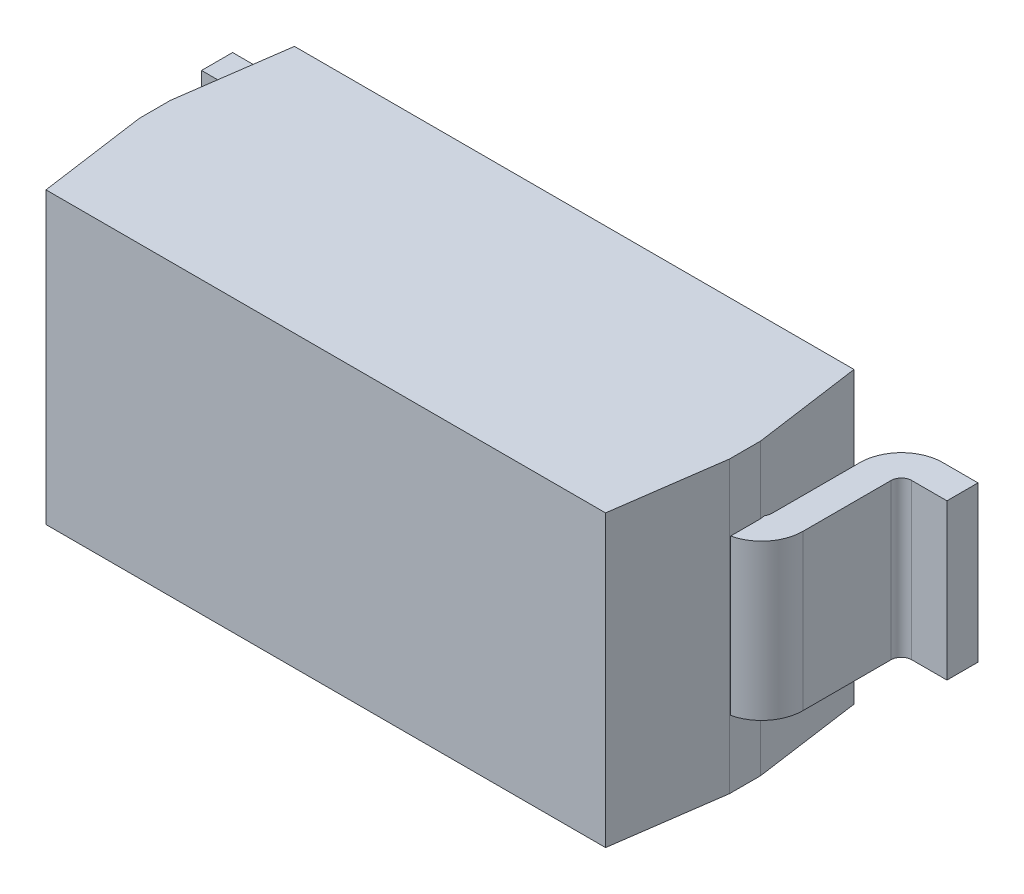
ISO-10303-21;
HEADER;
FILE_DESCRIPTION(('STEP AP214'),'2;1');
FILE_NAME('part.step','',(''),(''),'','','');
FILE_SCHEMA(('AUTOMOTIVE_DESIGN { 1 0 10303 214 1 1 1 1 }'));
ENDSEC;
DATA;
#1=APPLICATION_CONTEXT('core data for automotive mechanical design processes');
#2=APPLICATION_PROTOCOL_DEFINITION('international standard','automotive_design',2000,#1);
#3=PRODUCT_CONTEXT('',#1,'mechanical');
#4=PRODUCT('Part','Part','',(#3));
#5=PRODUCT_RELATED_PRODUCT_CATEGORY('part','',(#4));
#6=PRODUCT_DEFINITION_FORMATION('','',#4);
#7=PRODUCT_DEFINITION_CONTEXT('part definition',#1,'design');
#8=PRODUCT_DEFINITION('design','',#6,#7);
#9=PRODUCT_DEFINITION_SHAPE('','',#8);
#10=(LENGTH_UNIT() NAMED_UNIT(*) SI_UNIT(.MILLI.,.METRE.));
#11=(NAMED_UNIT(*) PLANE_ANGLE_UNIT() SI_UNIT($,.RADIAN.));
#12=(NAMED_UNIT(*) SI_UNIT($,.STERADIAN.) SOLID_ANGLE_UNIT());
#13=UNCERTAINTY_MEASURE_WITH_UNIT(LENGTH_MEASURE(1.E-05),#10,'distance_accuracy_value','');
#14=(GEOMETRIC_REPRESENTATION_CONTEXT(3) GLOBAL_UNCERTAINTY_ASSIGNED_CONTEXT((#13)) GLOBAL_UNIT_ASSIGNED_CONTEXT((#10,
#11,#12)) REPRESENTATION_CONTEXT('',''));
#15=CARTESIAN_POINT('',(0.,0.,0.));
#16=DIRECTION('',(0.,0.,1.));
#17=DIRECTION('',(1.,0.,0.));
#18=AXIS2_PLACEMENT_3D('',#15,#16,#17);
#19=CARTESIAN_POINT('',(1.425,0.,0.75));
#20=DIRECTION('',(-1.,0.,0.));
#21=DIRECTION('',(0.,0.,1.));
#22=AXIS2_PLACEMENT_3D('',#19,#20,#21);
#23=PLANE('',#22);
#24=DIRECTION('',(0.,0.,1.));
#25=VECTOR('',#24,1.);
#26=CARTESIAN_POINT('',(1.425,-0.7,0.75));
#27=LINE('',#26,#25);
#28=CARTESIAN_POINT('',(1.425,-0.7,0.675));
#29=VERTEX_POINT('',#28);
#30=CARTESIAN_POINT('',(1.425,-0.7,0.825));
#31=VERTEX_POINT('',#30);
#32=EDGE_CURVE('E367',#29,#31,#27,.T.);
#33=ORIENTED_EDGE('',*,*,#32,.F.);
#34=DIRECTION('',(0.,1.,0.));
#35=VECTOR('',#34,1.);
#36=CARTESIAN_POINT('',(1.425,0.,0.675));
#37=LINE('',#36,#35);
#38=CARTESIAN_POINT('',(1.425,-0.375,0.675));
#39=VERTEX_POINT('',#38);
#40=EDGE_CURVE('E340',#39,#29,#37,.F.);
#41=ORIENTED_EDGE('',*,*,#40,.F.);
#42=DIRECTION('',(0.,0.,1.));
#43=VECTOR('',#42,1.);
#44=CARTESIAN_POINT('',(1.425,-0.375,0.75));
#45=LINE('',#44,#43);
#46=CARTESIAN_POINT('',(1.425,-0.375,0.819871752699051));
#47=VERTEX_POINT('',#46);
#48=EDGE_CURVE('E334',#47,#39,#45,.F.);
#49=ORIENTED_EDGE('',*,*,#48,.F.);
#50=DIRECTION('',(0.,-1.,0.));
#51=VECTOR('',#50,1.);
#52=CARTESIAN_POINT('',(1.425,0.375,0.819871752699051));
#53=LINE('',#52,#51);
#54=CARTESIAN_POINT('',(1.425,0.375,0.819871752699051));
#55=VERTEX_POINT('',#54);
#56=EDGE_CURVE('E230',#55,#47,#53,.T.);
#57=ORIENTED_EDGE('',*,*,#56,.F.);
#58=DIRECTION('',(0.,0.,1.));
#59=VECTOR('',#58,1.);
#60=CARTESIAN_POINT('',(1.425,0.375,0.75));
#61=LINE('',#60,#59);
#62=CARTESIAN_POINT('',(1.425,0.375,0.675));
#63=VERTEX_POINT('',#62);
#64=EDGE_CURVE('E210',#63,#55,#61,.T.);
#65=ORIENTED_EDGE('',*,*,#64,.F.);
#66=DIRECTION('',(0.,1.,0.));
#67=VECTOR('',#66,1.);
#68=CARTESIAN_POINT('',(1.425,0.,0.675));
#69=LINE('',#68,#67);
#70=CARTESIAN_POINT('',(1.425,0.7,0.675));
#71=VERTEX_POINT('',#70);
#72=EDGE_CURVE('E335',#71,#63,#69,.F.);
#73=ORIENTED_EDGE('',*,*,#72,.F.);
#74=DIRECTION('',(0.,0.,1.));
#75=VECTOR('',#74,1.);
#76=CARTESIAN_POINT('',(1.425,0.7,0.75));
#77=LINE('',#76,#75);
#78=CARTESIAN_POINT('',(1.425,0.7,0.825));
#79=VERTEX_POINT('',#78);
#80=EDGE_CURVE('E393',#79,#71,#77,.F.);
#81=ORIENTED_EDGE('',*,*,#80,.F.);
#82=DIRECTION('',(0.,1.,0.));
#83=VECTOR('',#82,1.);
#84=CARTESIAN_POINT('',(1.425,0.,0.825));
#85=LINE('',#84,#83);
#86=EDGE_CURVE('E284',#31,#79,#85,.T.);
#87=ORIENTED_EDGE('',*,*,#86,.F.);
#88=EDGE_LOOP('',(#33,#41,#49,#57,#65,#73,#81,#87));
#89=FACE_BOUND('',#88,.T.);
#90=ADVANCED_FACE('F16',(#89),#23,.F.);
#91=CARTESIAN_POINT('',(-1.425,0.,0.75));
#92=DIRECTION('',(1.,0.,0.));
#93=DIRECTION('',(0.,0.,-1.));
#94=AXIS2_PLACEMENT_3D('',#91,#92,#93);
#95=PLANE('',#94);
#96=DIRECTION('',(0.,0.,-1.));
#97=VECTOR('',#96,1.);
#98=CARTESIAN_POINT('',(-1.425,0.7,0.75));
#99=LINE('',#98,#97);
#100=CARTESIAN_POINT('',(-1.425,0.7,0.675));
#101=VERTEX_POINT('',#100);
#102=CARTESIAN_POINT('',(-1.425,0.7,0.825000000000001));
#103=VERTEX_POINT('',#102);
#104=EDGE_CURVE('E316',#101,#103,#99,.F.);
#105=ORIENTED_EDGE('',*,*,#104,.F.);
#106=DIRECTION('',(0.,1.,0.));
#107=VECTOR('',#106,1.);
#108=CARTESIAN_POINT('',(-1.425,0.,0.675));
#109=LINE('',#108,#107);
#110=CARTESIAN_POINT('',(-1.425,0.375,0.675));
#111=VERTEX_POINT('',#110);
#112=EDGE_CURVE('E330',#111,#101,#109,.T.);
#113=ORIENTED_EDGE('',*,*,#112,.F.);
#114=DIRECTION('',(0.,0.,-1.));
#115=VECTOR('',#114,1.);
#116=CARTESIAN_POINT('',(-1.425,0.375,0.75));
#117=LINE('',#116,#115);
#118=CARTESIAN_POINT('',(-1.425,0.375,0.819871752699051));
#119=VERTEX_POINT('',#118);
#120=EDGE_CURVE('E324',#119,#111,#117,.T.);
#121=ORIENTED_EDGE('',*,*,#120,.F.);
#122=DIRECTION('',(0.,1.,0.));
#123=VECTOR('',#122,1.);
#124=CARTESIAN_POINT('',(-1.425,-0.375,0.819871752699051));
#125=LINE('',#124,#123);
#126=CARTESIAN_POINT('',(-1.425,-0.375,0.819871752699051));
#127=VERTEX_POINT('',#126);
#128=EDGE_CURVE('E271',#127,#119,#125,.T.);
#129=ORIENTED_EDGE('',*,*,#128,.F.);
#130=DIRECTION('',(0.,0.,-1.));
#131=VECTOR('',#130,1.);
#132=CARTESIAN_POINT('',(-1.425,-0.375,0.75));
#133=LINE('',#132,#131);
#134=CARTESIAN_POINT('',(-1.425,-0.375,0.675));
#135=VERTEX_POINT('',#134);
#136=EDGE_CURVE('E322',#135,#127,#133,.F.);
#137=ORIENTED_EDGE('',*,*,#136,.F.);
#138=DIRECTION('',(0.,1.,0.));
#139=VECTOR('',#138,1.);
#140=CARTESIAN_POINT('',(-1.425,0.,0.675));
#141=LINE('',#140,#139);
#142=CARTESIAN_POINT('',(-1.425,-0.7,0.675));
#143=VERTEX_POINT('',#142);
#144=EDGE_CURVE('E325',#143,#135,#141,.T.);
#145=ORIENTED_EDGE('',*,*,#144,.F.);
#146=DIRECTION('',(0.,0.,-1.));
#147=VECTOR('',#146,1.);
#148=CARTESIAN_POINT('',(-1.425,-0.7,0.75));
#149=LINE('',#148,#147);
#150=CARTESIAN_POINT('',(-1.425,-0.7,0.825000000000001));
#151=VERTEX_POINT('',#150);
#152=EDGE_CURVE('E357',#151,#143,#149,.T.);
#153=ORIENTED_EDGE('',*,*,#152,.F.);
#154=DIRECTION('',(0.,1.,0.));
#155=VECTOR('',#154,1.);
#156=CARTESIAN_POINT('',(-1.425,0.,0.825));
#157=LINE('',#156,#155);
#158=EDGE_CURVE('E283',#103,#151,#157,.F.);
#159=ORIENTED_EDGE('',*,*,#158,.F.);
#160=EDGE_LOOP('',(#105,#113,#121,#129,#137,#145,#153,#159));
#161=FACE_BOUND('',#160,.T.);
#162=ADVANCED_FACE('F664',(#161),#95,.F.);
#163=CARTESIAN_POINT('',(1.38,0.375,0.625));
#164=DIRECTION('',(0.,-1.,0.));
#165=DIRECTION('',(0.,0.,-1.));
#166=AXIS2_PLACEMENT_3D('',#163,#164,#165);
#167=CYLINDRICAL_SURFACE('',#166,0.2);
#168=CARTESIAN_POINT('',(1.38,-0.375,0.625));
#169=DIRECTION('',(0.,-1.,0.));
#170=DIRECTION('',(0.,0.,-1.));
#171=AXIS2_PLACEMENT_3D('',#168,#169,#170);
#172=CIRCLE('',#171,0.2);
#173=CARTESIAN_POINT('',(1.58,-0.375,0.625));
#174=VERTEX_POINT('',#173);
#175=EDGE_CURVE('E225',#47,#174,#172,.F.);
#176=ORIENTED_EDGE('',*,*,#175,.T.);
#177=DIRECTION('',(0.,1.,0.));
#178=VECTOR('',#177,1.);
#179=CARTESIAN_POINT('',(1.58,0.375,0.625));
#180=LINE('',#179,#178);
#181=CARTESIAN_POINT('',(1.58,0.375,0.625));
#182=VERTEX_POINT('',#181);
#183=EDGE_CURVE('E222',#182,#174,#180,.F.);
#184=ORIENTED_EDGE('',*,*,#183,.F.);
#185=CARTESIAN_POINT('',(1.38,0.375,0.625));
#186=DIRECTION('',(0.,-1.,0.));
#187=DIRECTION('',(0.,0.,-1.));
#188=AXIS2_PLACEMENT_3D('',#185,#186,#187);
#189=CIRCLE('',#188,0.2);
#190=EDGE_CURVE('E19',#55,#182,#189,.F.);
#191=ORIENTED_EDGE('',*,*,#190,.F.);
#192=ORIENTED_EDGE('',*,*,#56,.T.);
#193=EDGE_LOOP('',(#176,#184,#191,#192));
#194=FACE_BOUND('',#193,.T.);
#195=ADVANCED_FACE('F223',(#194),#167,.T.);
#196=CARTESIAN_POINT('',(1.58,0.375,0.2));
#197=DIRECTION('',(1.,0.,0.));
#198=DIRECTION('',(0.,0.,-1.));
#199=AXIS2_PLACEMENT_3D('',#196,#197,#198);
#200=PLANE('',#199);
#201=DIRECTION('',(0.,0.,1.));
#202=VECTOR('',#201,1.);
#203=CARTESIAN_POINT('',(1.58,-0.375,0.825));
#204=LINE('',#203,#202);
#205=CARTESIAN_POINT('',(1.58,-0.375,0.2));
#206=VERTEX_POINT('',#205);
#207=EDGE_CURVE('E448',#174,#206,#204,.F.);
#208=ORIENTED_EDGE('',*,*,#207,.T.);
#209=DIRECTION('',(0.,-1.,0.));
#210=VECTOR('',#209,1.);
#211=CARTESIAN_POINT('',(1.58,0.375,0.2));
#212=LINE('',#211,#210);
#213=CARTESIAN_POINT('',(1.58,0.375,0.2));
#214=VERTEX_POINT('',#213);
#215=EDGE_CURVE('E229',#206,#214,#212,.F.);
#216=ORIENTED_EDGE('',*,*,#215,.T.);
#217=DIRECTION('',(0.,0.,1.));
#218=VECTOR('',#217,1.);
#219=CARTESIAN_POINT('',(1.58,0.375,0.825));
#220=LINE('',#219,#218);
#221=EDGE_CURVE('E216',#182,#214,#220,.F.);
#222=ORIENTED_EDGE('',*,*,#221,.F.);
#223=ORIENTED_EDGE('',*,*,#183,.T.);
#224=EDGE_LOOP('',(#208,#216,#222,#223));
#225=FACE_BOUND('',#224,.T.);
#226=ADVANCED_FACE('F232',(#225),#200,.T.);
#227=CARTESIAN_POINT('',(1.63,0.375,0.2));
#228=DIRECTION('',(0.,-1.,0.));
#229=DIRECTION('',(0.,0.,-1.));
#230=AXIS2_PLACEMENT_3D('',#227,#228,#229);
#231=CYLINDRICAL_SURFACE('',#230,0.05);
#232=ORIENTED_EDGE('',*,*,#215,.F.);
#233=CARTESIAN_POINT('',(1.63,-0.375,0.2));
#234=DIRECTION('',(0.,-1.,0.));
#235=DIRECTION('',(0.,0.,-1.));
#236=AXIS2_PLACEMENT_3D('',#233,#234,#235);
#237=CIRCLE('',#236,0.05);
#238=CARTESIAN_POINT('',(1.63,-0.375,0.15));
#239=VERTEX_POINT('',#238);
#240=EDGE_CURVE('E445',#206,#239,#237,.T.);
#241=ORIENTED_EDGE('',*,*,#240,.T.);
#242=DIRECTION('',(0.,-1.,0.));
#243=VECTOR('',#242,1.);
#244=CARTESIAN_POINT('',(1.63,0.375,0.15));
#245=LINE('',#244,#243);
#246=CARTESIAN_POINT('',(1.63,0.375,0.15));
#247=VERTEX_POINT('',#246);
#248=EDGE_CURVE('E310',#247,#239,#245,.T.);
#249=ORIENTED_EDGE('',*,*,#248,.F.);
#250=CARTESIAN_POINT('',(1.63,0.375,0.2));
#251=DIRECTION('',(0.,-1.,0.));
#252=DIRECTION('',(0.,0.,-1.));
#253=AXIS2_PLACEMENT_3D('',#250,#251,#252);
#254=CIRCLE('',#253,0.05);
#255=EDGE_CURVE('E234',#214,#247,#254,.T.);
#256=ORIENTED_EDGE('',*,*,#255,.F.);
#257=EDGE_LOOP('',(#232,#241,#249,#256));
#258=FACE_BOUND('',#257,.T.);
#259=ADVANCED_FACE('F657',(#258),#231,.F.);
#260=CARTESIAN_POINT('',(1.8,0.375,0.15));
#261=DIRECTION('',(0.,0.,1.));
#262=DIRECTION('',(0.,-1.,0.));
#263=AXIS2_PLACEMENT_3D('',#260,#261,#262);
#264=PLANE('',#263);
#265=DIRECTION('',(1.,0.,0.));
#266=VECTOR('',#265,1.);
#267=CARTESIAN_POINT('',(1.425,-0.375,0.15));
#268=LINE('',#267,#266);
#269=CARTESIAN_POINT('',(1.8,-0.375,0.15));
#270=VERTEX_POINT('',#269);
#271=EDGE_CURVE('E306',#239,#270,#268,.T.);
#272=ORIENTED_EDGE('',*,*,#271,.T.);
#273=DIRECTION('',(0.,1.,0.));
#274=VECTOR('',#273,1.);
#275=CARTESIAN_POINT('',(1.8,0.375,0.15));
#276=LINE('',#275,#274);
#277=CARTESIAN_POINT('',(1.8,0.375,0.15));
#278=VERTEX_POINT('',#277);
#279=EDGE_CURVE('E299',#278,#270,#276,.F.);
#280=ORIENTED_EDGE('',*,*,#279,.F.);
#281=DIRECTION('',(1.,0.,0.));
#282=VECTOR('',#281,1.);
#283=CARTESIAN_POINT('',(1.425,0.375,0.15));
#284=LINE('',#283,#282);
#285=EDGE_CURVE('E236',#247,#278,#284,.T.);
#286=ORIENTED_EDGE('',*,*,#285,.F.);
#287=ORIENTED_EDGE('',*,*,#248,.T.);
#288=EDGE_LOOP('',(#272,#280,#286,#287));
#289=FACE_BOUND('',#288,.T.);
#290=ADVANCED_FACE('F469',(#289),#264,.T.);
#291=CARTESIAN_POINT('',(1.8,0.375,0.));
#292=DIRECTION('',(1.,0.,0.));
#293=DIRECTION('',(0.,0.,-1.));
#294=AXIS2_PLACEMENT_3D('',#291,#292,#293);
#295=PLANE('',#294);
#296=DIRECTION('',(0.,0.,1.));
#297=VECTOR('',#296,1.);
#298=CARTESIAN_POINT('',(1.8,-0.375,0.825));
#299=LINE('',#298,#297);
#300=CARTESIAN_POINT('',(1.8,-0.375,0.));
#301=VERTEX_POINT('',#300);
#302=EDGE_CURVE('E302',#270,#301,#299,.F.);
#303=ORIENTED_EDGE('',*,*,#302,.T.);
#304=DIRECTION('',(0.,1.,0.));
#305=VECTOR('',#304,1.);
#306=CARTESIAN_POINT('',(1.8,0.375,0.));
#307=LINE('',#306,#305);
#308=CARTESIAN_POINT('',(1.8,0.375,0.));
#309=VERTEX_POINT('',#308);
#310=EDGE_CURVE('E297',#309,#301,#307,.F.);
#311=ORIENTED_EDGE('',*,*,#310,.F.);
#312=DIRECTION('',(0.,0.,1.));
#313=VECTOR('',#312,1.);
#314=CARTESIAN_POINT('',(1.8,0.375,0.825));
#315=LINE('',#314,#313);
#316=EDGE_CURVE('E317',#278,#309,#315,.F.);
#317=ORIENTED_EDGE('',*,*,#316,.F.);
#318=ORIENTED_EDGE('',*,*,#279,.T.);
#319=EDGE_LOOP('',(#303,#311,#317,#318));
#320=FACE_BOUND('',#319,.T.);
#321=ADVANCED_FACE('F473',(#320),#295,.T.);
#322=CARTESIAN_POINT('',(1.63,0.375,0.));
#323=DIRECTION('',(0.,0.,-1.));
#324=DIRECTION('',(0.,1.,0.));
#325=AXIS2_PLACEMENT_3D('',#322,#323,#324);
#326=PLANE('',#325);
#327=DIRECTION('',(1.,0.,0.));
#328=VECTOR('',#327,1.);
#329=CARTESIAN_POINT('',(1.425,-0.375,0.));
#330=LINE('',#329,#328);
#331=CARTESIAN_POINT('',(1.63,-0.375,0.));
#332=VERTEX_POINT('',#331);
#333=EDGE_CURVE('E305',#301,#332,#330,.F.);
#334=ORIENTED_EDGE('',*,*,#333,.T.);
#335=DIRECTION('',(0.,-1.,0.));
#336=VECTOR('',#335,1.);
#337=CARTESIAN_POINT('',(1.63,0.375,0.));
#338=LINE('',#337,#336);
#339=CARTESIAN_POINT('',(1.63,0.375,0.));
#340=VERTEX_POINT('',#339);
#341=EDGE_CURVE('E295',#340,#332,#338,.T.);
#342=ORIENTED_EDGE('',*,*,#341,.F.);
#343=DIRECTION('',(1.,0.,0.));
#344=VECTOR('',#343,1.);
#345=CARTESIAN_POINT('',(1.425,0.375,0.));
#346=LINE('',#345,#344);
#347=EDGE_CURVE('E319',#309,#340,#346,.F.);
#348=ORIENTED_EDGE('',*,*,#347,.F.);
#349=ORIENTED_EDGE('',*,*,#310,.T.);
#350=EDGE_LOOP('',(#334,#342,#348,#349));
#351=FACE_BOUND('',#350,.T.);
#352=ADVANCED_FACE('F477',(#351),#326,.T.);
#353=CARTESIAN_POINT('',(1.63,0.375,0.2));
#354=DIRECTION('',(0.,-1.,0.));
#355=DIRECTION('',(0.,0.,-1.));
#356=AXIS2_PLACEMENT_3D('',#353,#354,#355);
#357=CYLINDRICAL_SURFACE('',#356,0.2);
#358=CARTESIAN_POINT('',(1.63,-0.375,0.2));
#359=DIRECTION('',(0.,-1.,0.));
#360=DIRECTION('',(0.,0.,-1.));
#361=AXIS2_PLACEMENT_3D('',#358,#359,#360);
#362=CIRCLE('',#361,0.2);
#363=CARTESIAN_POINT('',(1.43,-0.375,0.2));
#364=VERTEX_POINT('',#363);
#365=EDGE_CURVE('E442',#332,#364,#362,.F.);
#366=ORIENTED_EDGE('',*,*,#365,.T.);
#367=DIRECTION('',(0.,1.,0.));
#368=VECTOR('',#367,1.);
#369=CARTESIAN_POINT('',(1.43,0.375,0.2));
#370=LINE('',#369,#368);
#371=CARTESIAN_POINT('',(1.43,0.375,0.2));
#372=VERTEX_POINT('',#371);
#373=EDGE_CURVE('E293',#372,#364,#370,.F.);
#374=ORIENTED_EDGE('',*,*,#373,.F.);
#375=CARTESIAN_POINT('',(1.63,0.375,0.2));
#376=DIRECTION('',(0.,-1.,0.));
#377=DIRECTION('',(0.,0.,-1.));
#378=AXIS2_PLACEMENT_3D('',#375,#376,#377);
#379=CIRCLE('',#378,0.2);
#380=EDGE_CURVE('E452',#340,#372,#379,.F.);
#381=ORIENTED_EDGE('',*,*,#380,.F.);
#382=ORIENTED_EDGE('',*,*,#341,.T.);
#383=EDGE_LOOP('',(#366,#374,#381,#382));
#384=FACE_BOUND('',#383,.T.);
#385=ADVANCED_FACE('F480',(#384),#357,.T.);
#386=CARTESIAN_POINT('',(1.43,0.375,0.625));
#387=DIRECTION('',(-1.,0.,0.));
#388=DIRECTION('',(0.,0.,1.));
#389=AXIS2_PLACEMENT_3D('',#386,#387,#388);
#390=PLANE('',#389);
#391=DIRECTION('',(0.,0.,1.));
#392=VECTOR('',#391,1.);
#393=CARTESIAN_POINT('',(1.43,-0.375,0.825));
#394=LINE('',#393,#392);
#395=CARTESIAN_POINT('',(1.43,-0.375,0.625));
#396=VERTEX_POINT('',#395);
#397=EDGE_CURVE('E441',#364,#396,#394,.T.);
#398=ORIENTED_EDGE('',*,*,#397,.T.);
#399=DIRECTION('',(0.,-1.,0.));
#400=VECTOR('',#399,1.);
#401=CARTESIAN_POINT('',(1.43,0.375,0.625));
#402=LINE('',#401,#400);
#403=CARTESIAN_POINT('',(1.43,0.375,0.625));
#404=VERTEX_POINT('',#403);
#405=EDGE_CURVE('E288',#396,#404,#402,.F.);
#406=ORIENTED_EDGE('',*,*,#405,.T.);
#407=DIRECTION('',(0.,0.,1.));
#408=VECTOR('',#407,1.);
#409=CARTESIAN_POINT('',(1.43,0.375,0.825));
#410=LINE('',#409,#408);
#411=EDGE_CURVE('E292',#372,#404,#410,.T.);
#412=ORIENTED_EDGE('',*,*,#411,.F.);
#413=ORIENTED_EDGE('',*,*,#373,.T.);
#414=EDGE_LOOP('',(#398,#406,#412,#413));
#415=FACE_BOUND('',#414,.T.);
#416=ADVANCED_FACE('F485',(#415),#390,.T.);
#417=CARTESIAN_POINT('',(1.38810803089062,0.,1.0875));
#418=DIRECTION('',(0.99026806874157,0.,0.139173100960066));
#419=DIRECTION('',(0.139173100960066,0.,-0.99026806874157));
#420=AXIS2_PLACEMENT_3D('',#417,#418,#419);
#421=PLANE('',#420);
#422=DIRECTION('',(0.139173100960066,0.,-0.99026806874157));
#423=VECTOR('',#422,1.);
#424=CARTESIAN_POINT('',(1.38810803089062,-0.7,1.0875));
#425=LINE('',#424,#423);
#426=CARTESIAN_POINT('',(1.35121606178124,-0.7,1.35));
#427=VERTEX_POINT('',#426);
#428=EDGE_CURVE('E285',#427,#31,#425,.T.);
#429=ORIENTED_EDGE('',*,*,#428,.T.);
#430=ORIENTED_EDGE('',*,*,#86,.T.);
#431=DIRECTION('',(0.139173100960066,0.,-0.99026806874157));
#432=VECTOR('',#431,1.);
#433=CARTESIAN_POINT('',(1.38810803089062,0.7,1.0875));
#434=LINE('',#433,#432);
#435=CARTESIAN_POINT('',(1.35121606178124,0.7,1.35));
#436=VERTEX_POINT('',#435);
#437=EDGE_CURVE('E287',#79,#436,#434,.F.);
#438=ORIENTED_EDGE('',*,*,#437,.T.);
#439=DIRECTION('',(0.,1.,0.));
#440=VECTOR('',#439,1.);
#441=CARTESIAN_POINT('',(1.35121606178124,0.,1.35));
#442=LINE('',#441,#440);
#443=EDGE_CURVE('E440',#436,#427,#442,.F.);
#444=ORIENTED_EDGE('',*,*,#443,.T.);
#445=EDGE_LOOP('',(#429,#430,#438,#444));
#446=FACE_BOUND('',#445,.T.);
#447=ADVANCED_FACE('F642',(#446),#421,.T.);
#448=CARTESIAN_POINT('',(-1.38810803089062,0.,1.0875));
#449=DIRECTION('',(-0.99026806874157,0.,0.139173100960065));
#450=DIRECTION('',(0.139173100960065,0.,0.99026806874157));
#451=AXIS2_PLACEMENT_3D('',#448,#449,#450);
#452=PLANE('',#451);
#453=DIRECTION('',(0.139173100960065,0.,0.99026806874157));
#454=VECTOR('',#453,1.);
#455=CARTESIAN_POINT('',(-1.38810803089062,-0.7,1.0875));
#456=LINE('',#455,#454);
#457=CARTESIAN_POINT('',(-1.35121606178124,-0.7,1.35));
#458=VERTEX_POINT('',#457);
#459=EDGE_CURVE('E274',#151,#458,#456,.T.);
#460=ORIENTED_EDGE('',*,*,#459,.T.);
#461=DIRECTION('',(0.,1.,0.));
#462=VECTOR('',#461,1.);
#463=CARTESIAN_POINT('',(-1.35121606178124,0.,1.35));
#464=LINE('',#463,#462);
#465=CARTESIAN_POINT('',(-1.35121606178124,0.7,1.35));
#466=VERTEX_POINT('',#465);
#467=EDGE_CURVE('E436',#458,#466,#464,.T.);
#468=ORIENTED_EDGE('',*,*,#467,.T.);
#469=DIRECTION('',(0.139173100960065,0.,0.99026806874157));
#470=VECTOR('',#469,1.);
#471=CARTESIAN_POINT('',(-1.38810803089062,0.7,1.0875));
#472=LINE('',#471,#470);
#473=EDGE_CURVE('E281',#466,#103,#472,.F.);
#474=ORIENTED_EDGE('',*,*,#473,.T.);
#475=ORIENTED_EDGE('',*,*,#158,.T.);
#476=EDGE_LOOP('',(#460,#468,#474,#475));
#477=FACE_BOUND('',#476,.T.);
#478=ADVANCED_FACE('F638',(#477),#452,.T.);
#479=CARTESIAN_POINT('',(-1.38,-0.375,0.625));
#480=DIRECTION('',(0.,1.,0.));
#481=DIRECTION('',(-1.,0.,0.));
#482=AXIS2_PLACEMENT_3D('',#479,#480,#481);
#483=CYLINDRICAL_SURFACE('',#482,0.2);
#484=CARTESIAN_POINT('',(-1.38,0.375,0.625));
#485=DIRECTION('',(0.,1.,0.));
#486=DIRECTION('',(-1.,0.,0.));
#487=AXIS2_PLACEMENT_3D('',#484,#485,#486);
#488=CIRCLE('',#487,0.2);
#489=CARTESIAN_POINT('',(-1.58,0.375,0.625));
#490=VERTEX_POINT('',#489);
#491=EDGE_CURVE('E424',#119,#490,#488,.F.);
#492=ORIENTED_EDGE('',*,*,#491,.T.);
#493=DIRECTION('',(0.,-1.,0.));
#494=VECTOR('',#493,1.);
#495=CARTESIAN_POINT('',(-1.58,-0.375,0.625));
#496=LINE('',#495,#494);
#497=CARTESIAN_POINT('',(-1.58,-0.375,0.625));
#498=VERTEX_POINT('',#497);
#499=EDGE_CURVE('E269',#498,#490,#496,.F.);
#500=ORIENTED_EDGE('',*,*,#499,.F.);
#501=CARTESIAN_POINT('',(-1.38,-0.375,0.625));
#502=DIRECTION('',(0.,1.,0.));
#503=DIRECTION('',(-1.,0.,0.));
#504=AXIS2_PLACEMENT_3D('',#501,#502,#503);
#505=CIRCLE('',#504,0.2);
#506=EDGE_CURVE('E434',#127,#498,#505,.F.);
#507=ORIENTED_EDGE('',*,*,#506,.F.);
#508=ORIENTED_EDGE('',*,*,#128,.T.);
#509=EDGE_LOOP('',(#492,#500,#507,#508));
#510=FACE_BOUND('',#509,.T.);
#511=ADVANCED_FACE('F634',(#510),#483,.T.);
#512=CARTESIAN_POINT('',(-1.58,-0.375,0.2));
#513=DIRECTION('',(-1.,0.,0.));
#514=DIRECTION('',(0.,-1.,0.));
#515=AXIS2_PLACEMENT_3D('',#512,#513,#514);
#516=PLANE('',#515);
#517=DIRECTION('',(0.,0.,1.));
#518=VECTOR('',#517,1.);
#519=CARTESIAN_POINT('',(-1.58,0.375,0.825));
#520=LINE('',#519,#518);
#521=CARTESIAN_POINT('',(-1.58,0.375,0.2));
#522=VERTEX_POINT('',#521);
#523=EDGE_CURVE('E423',#490,#522,#520,.F.);
#524=ORIENTED_EDGE('',*,*,#523,.T.);
#525=DIRECTION('',(0.,1.,0.));
#526=VECTOR('',#525,1.);
#527=CARTESIAN_POINT('',(-1.58,-0.375,0.2));
#528=LINE('',#527,#526);
#529=CARTESIAN_POINT('',(-1.58,-0.375,0.2));
#530=VERTEX_POINT('',#529);
#531=EDGE_CURVE('E266',#522,#530,#528,.F.);
#532=ORIENTED_EDGE('',*,*,#531,.T.);
#533=DIRECTION('',(0.,0.,1.));
#534=VECTOR('',#533,1.);
#535=CARTESIAN_POINT('',(-1.58,-0.375,0.825));
#536=LINE('',#535,#534);
#537=EDGE_CURVE('E433',#498,#530,#536,.F.);
#538=ORIENTED_EDGE('',*,*,#537,.F.);
#539=ORIENTED_EDGE('',*,*,#499,.T.);
#540=EDGE_LOOP('',(#524,#532,#538,#539));
#541=FACE_BOUND('',#540,.T.);
#542=ADVANCED_FACE('F630',(#541),#516,.T.);
#543=CARTESIAN_POINT('',(-1.63,-0.375,0.2));
#544=DIRECTION('',(0.,1.,0.));
#545=DIRECTION('',(-1.,0.,0.));
#546=AXIS2_PLACEMENT_3D('',#543,#544,#545);
#547=CYLINDRICAL_SURFACE('',#546,0.05);
#548=ORIENTED_EDGE('',*,*,#531,.F.);
#549=CARTESIAN_POINT('',(-1.63,0.375,0.2));
#550=DIRECTION('',(0.,1.,0.));
#551=DIRECTION('',(-1.,0.,0.));
#552=AXIS2_PLACEMENT_3D('',#549,#550,#551);
#553=CIRCLE('',#552,0.05);
#554=CARTESIAN_POINT('',(-1.63,0.375,0.15));
#555=VERTEX_POINT('',#554);
#556=EDGE_CURVE('E420',#522,#555,#553,.T.);
#557=ORIENTED_EDGE('',*,*,#556,.T.);
#558=DIRECTION('',(0.,-1.,0.));
#559=VECTOR('',#558,1.);
#560=CARTESIAN_POINT('',(-1.63,-0.375,0.15));
#561=LINE('',#560,#559);
#562=CARTESIAN_POINT('',(-1.63,-0.375,0.15));
#563=VERTEX_POINT('',#562);
#564=EDGE_CURVE('E262',#563,#555,#561,.F.);
#565=ORIENTED_EDGE('',*,*,#564,.F.);
#566=CARTESIAN_POINT('',(-1.63,-0.375,0.2));
#567=DIRECTION('',(0.,1.,0.));
#568=DIRECTION('',(-1.,0.,0.));
#569=AXIS2_PLACEMENT_3D('',#566,#567,#568);
#570=CIRCLE('',#569,0.05);
#571=EDGE_CURVE('E431',#530,#563,#570,.T.);
#572=ORIENTED_EDGE('',*,*,#571,.F.);
#573=EDGE_LOOP('',(#548,#557,#565,#572));
#574=FACE_BOUND('',#573,.T.);
#575=ADVANCED_FACE('F626',(#574),#547,.F.);
#576=CARTESIAN_POINT('',(-1.8,-0.375,0.15));
#577=DIRECTION('',(0.,0.,1.));
#578=DIRECTION('',(0.,-1.,0.));
#579=AXIS2_PLACEMENT_3D('',#576,#577,#578);
#580=PLANE('',#579);
#581=DIRECTION('',(1.,0.,0.));
#582=VECTOR('',#581,1.);
#583=CARTESIAN_POINT('',(-1.425,0.375,0.15));
#584=LINE('',#583,#582);
#585=CARTESIAN_POINT('',(-1.8,0.375,0.15));
#586=VERTEX_POINT('',#585);
#587=EDGE_CURVE('E258',#555,#586,#584,.F.);
#588=ORIENTED_EDGE('',*,*,#587,.T.);
#589=DIRECTION('',(0.,-1.,0.));
#590=VECTOR('',#589,1.);
#591=CARTESIAN_POINT('',(-1.8,-0.375,0.15));
#592=LINE('',#591,#590);
#593=CARTESIAN_POINT('',(-1.8,-0.375,0.15));
#594=VERTEX_POINT('',#593);
#595=EDGE_CURVE('E251',#594,#586,#592,.F.);
#596=ORIENTED_EDGE('',*,*,#595,.F.);
#597=DIRECTION('',(1.,0.,0.));
#598=VECTOR('',#597,1.);
#599=CARTESIAN_POINT('',(-1.425,-0.375,0.15));
#600=LINE('',#599,#598);
#601=EDGE_CURVE('E278',#563,#594,#600,.F.);
#602=ORIENTED_EDGE('',*,*,#601,.F.);
#603=ORIENTED_EDGE('',*,*,#564,.T.);
#604=EDGE_LOOP('',(#588,#596,#602,#603));
#605=FACE_BOUND('',#604,.T.);
#606=ADVANCED_FACE('F622',(#605),#580,.T.);
#607=CARTESIAN_POINT('',(-1.8,-0.375,0.));
#608=DIRECTION('',(-1.,0.,0.));
#609=DIRECTION('',(0.,-1.,0.));
#610=AXIS2_PLACEMENT_3D('',#607,#608,#609);
#611=PLANE('',#610);
#612=DIRECTION('',(0.,0.,1.));
#613=VECTOR('',#612,1.);
#614=CARTESIAN_POINT('',(-1.8,0.375,0.825));
#615=LINE('',#614,#613);
#616=CARTESIAN_POINT('',(-1.8,0.375,0.));
#617=VERTEX_POINT('',#616);
#618=EDGE_CURVE('E254',#586,#617,#615,.F.);
#619=ORIENTED_EDGE('',*,*,#618,.T.);
#620=DIRECTION('',(0.,1.,0.));
#621=VECTOR('',#620,1.);
#622=CARTESIAN_POINT('',(-1.8,-0.375,0.));
#623=LINE('',#622,#621);
#624=CARTESIAN_POINT('',(-1.8,-0.375,0.));
#625=VERTEX_POINT('',#624);
#626=EDGE_CURVE('E249',#625,#617,#623,.T.);
#627=ORIENTED_EDGE('',*,*,#626,.F.);
#628=DIRECTION('',(0.,0.,1.));
#629=VECTOR('',#628,1.);
#630=CARTESIAN_POINT('',(-1.8,-0.375,0.825));
#631=LINE('',#630,#629);
#632=EDGE_CURVE('E275',#594,#625,#631,.F.);
#633=ORIENTED_EDGE('',*,*,#632,.F.);
#634=ORIENTED_EDGE('',*,*,#595,.T.);
#635=EDGE_LOOP('',(#619,#627,#633,#634));
#636=FACE_BOUND('',#635,.T.);
#637=ADVANCED_FACE('F618',(#636),#611,.T.);
#638=CARTESIAN_POINT('',(-1.63,-0.375,0.));
#639=DIRECTION('',(0.,0.,-1.));
#640=DIRECTION('',(0.,1.,0.));
#641=AXIS2_PLACEMENT_3D('',#638,#639,#640);
#642=PLANE('',#641);
#643=DIRECTION('',(1.,0.,0.));
#644=VECTOR('',#643,1.);
#645=CARTESIAN_POINT('',(-1.425,0.375,0.));
#646=LINE('',#645,#644);
#647=CARTESIAN_POINT('',(-1.63,0.375,0.));
#648=VERTEX_POINT('',#647);
#649=EDGE_CURVE('E257',#617,#648,#646,.T.);
#650=ORIENTED_EDGE('',*,*,#649,.T.);
#651=DIRECTION('',(0.,1.,0.));
#652=VECTOR('',#651,1.);
#653=CARTESIAN_POINT('',(-1.63,-0.375,0.));
#654=LINE('',#653,#652);
#655=CARTESIAN_POINT('',(-1.63,-0.375,0.));
#656=VERTEX_POINT('',#655);
#657=EDGE_CURVE('E247',#656,#648,#654,.T.);
#658=ORIENTED_EDGE('',*,*,#657,.F.);
#659=DIRECTION('',(1.,0.,0.));
#660=VECTOR('',#659,1.);
#661=CARTESIAN_POINT('',(-1.425,-0.375,0.));
#662=LINE('',#661,#660);
#663=EDGE_CURVE('E277',#625,#656,#662,.T.);
#664=ORIENTED_EDGE('',*,*,#663,.F.);
#665=ORIENTED_EDGE('',*,*,#626,.T.);
#666=EDGE_LOOP('',(#650,#658,#664,#665));
#667=FACE_BOUND('',#666,.T.);
#668=ADVANCED_FACE('F614',(#667),#642,.T.);
#669=CARTESIAN_POINT('',(-1.63,-0.375,0.2));
#670=DIRECTION('',(0.,1.,0.));
#671=DIRECTION('',(-1.,0.,0.));
#672=AXIS2_PLACEMENT_3D('',#669,#670,#671);
#673=CYLINDRICAL_SURFACE('',#672,0.2);
#674=CARTESIAN_POINT('',(-1.63,0.375,0.2));
#675=DIRECTION('',(0.,1.,0.));
#676=DIRECTION('',(-1.,0.,0.));
#677=AXIS2_PLACEMENT_3D('',#674,#675,#676);
#678=CIRCLE('',#677,0.2);
#679=CARTESIAN_POINT('',(-1.43,0.375,0.2));
#680=VERTEX_POINT('',#679);
#681=EDGE_CURVE('E417',#648,#680,#678,.F.);
#682=ORIENTED_EDGE('',*,*,#681,.T.);
#683=DIRECTION('',(0.,1.,0.));
#684=VECTOR('',#683,1.);
#685=CARTESIAN_POINT('',(-1.43,-0.375,0.2));
#686=LINE('',#685,#684);
#687=CARTESIAN_POINT('',(-1.43,-0.375,0.2));
#688=VERTEX_POINT('',#687);
#689=EDGE_CURVE('E220',#688,#680,#686,.T.);
#690=ORIENTED_EDGE('',*,*,#689,.F.);
#691=CARTESIAN_POINT('',(-1.63,-0.375,0.2));
#692=DIRECTION('',(0.,1.,0.));
#693=DIRECTION('',(-1.,0.,0.));
#694=AXIS2_PLACEMENT_3D('',#691,#692,#693);
#695=CIRCLE('',#694,0.2);
#696=EDGE_CURVE('E429',#656,#688,#695,.F.);
#697=ORIENTED_EDGE('',*,*,#696,.F.);
#698=ORIENTED_EDGE('',*,*,#657,.T.);
#699=EDGE_LOOP('',(#682,#690,#697,#698));
#700=FACE_BOUND('',#699,.T.);
#701=ADVANCED_FACE('F610',(#700),#673,.T.);
#702=CARTESIAN_POINT('',(-1.43,-0.375,0.625));
#703=DIRECTION('',(1.,0.,0.));
#704=DIRECTION('',(0.,1.,0.));
#705=AXIS2_PLACEMENT_3D('',#702,#703,#704);
#706=PLANE('',#705);
#707=DIRECTION('',(0.,0.,1.));
#708=VECTOR('',#707,1.);
#709=CARTESIAN_POINT('',(-1.43,0.375,0.825));
#710=LINE('',#709,#708);
#711=CARTESIAN_POINT('',(-1.43,0.375,0.625));
#712=VERTEX_POINT('',#711);
#713=EDGE_CURVE('E416',#680,#712,#710,.T.);
#714=ORIENTED_EDGE('',*,*,#713,.T.);
#715=DIRECTION('',(0.,1.,0.));
#716=VECTOR('',#715,1.);
#717=CARTESIAN_POINT('',(-1.43,-0.375,0.625));
#718=LINE('',#717,#716);
#719=CARTESIAN_POINT('',(-1.43,-0.375,0.625));
#720=VERTEX_POINT('',#719);
#721=EDGE_CURVE('E241',#712,#720,#718,.F.);
#722=ORIENTED_EDGE('',*,*,#721,.T.);
#723=DIRECTION('',(0.,0.,1.));
#724=VECTOR('',#723,1.);
#725=CARTESIAN_POINT('',(-1.43,-0.375,0.825));
#726=LINE('',#725,#724);
#727=EDGE_CURVE('E245',#688,#720,#726,.T.);
#728=ORIENTED_EDGE('',*,*,#727,.F.);
#729=ORIENTED_EDGE('',*,*,#689,.T.);
#730=EDGE_LOOP('',(#714,#722,#728,#729));
#731=FACE_BOUND('',#730,.T.);
#732=ADVANCED_FACE('F607',(#731),#706,.T.);
#733=CARTESIAN_POINT('',(1.425,0.375,0.825));
#734=DIRECTION('',(0.,1.,0.));
#735=DIRECTION('',(0.,0.,1.));
#736=AXIS2_PLACEMENT_3D('',#733,#734,#735);
#737=PLANE('',#736);
#738=ORIENTED_EDGE('',*,*,#411,.T.);
#739=CARTESIAN_POINT('',(1.38,0.375,0.625));
#740=DIRECTION('',(0.,-1.,0.));
#741=DIRECTION('',(0.,0.,-1.));
#742=AXIS2_PLACEMENT_3D('',#739,#740,#741);
#743=CIRCLE('',#742,0.05);
#744=CARTESIAN_POINT('',(1.42182380177004,0.375,0.652400175282288));
#745=VERTEX_POINT('',#744);
#746=EDGE_CURVE('E291',#404,#745,#743,.T.);
#747=ORIENTED_EDGE('',*,*,#746,.T.);
#748=DIRECTION('',(-0.139173100960066,0.,-0.99026806874157));
#749=VECTOR('',#748,1.);
#750=CARTESIAN_POINT('',(1.38810803089062,0.375,0.4125));
#751=LINE('',#750,#749);
#752=EDGE_CURVE('E495',#63,#745,#751,.T.);
#753=ORIENTED_EDGE('',*,*,#752,.F.);
#754=ORIENTED_EDGE('',*,*,#64,.T.);
#755=ORIENTED_EDGE('',*,*,#190,.T.);
#756=ORIENTED_EDGE('',*,*,#221,.T.);
#757=ORIENTED_EDGE('',*,*,#255,.T.);
#758=ORIENTED_EDGE('',*,*,#285,.T.);
#759=ORIENTED_EDGE('',*,*,#316,.T.);
#760=ORIENTED_EDGE('',*,*,#347,.T.);
#761=ORIENTED_EDGE('',*,*,#380,.T.);
#762=EDGE_LOOP('',(#738,#747,#753,#754,#755,#756,#757,#758,#759,#760,#761));
#763=FACE_BOUND('',#762,.T.);
#764=ADVANCED_FACE('F214',(#763),#737,.T.);
#765=CARTESIAN_POINT('',(1.38,0.375,0.625));
#766=DIRECTION('',(0.,-1.,0.));
#767=DIRECTION('',(0.,0.,-1.));
#768=AXIS2_PLACEMENT_3D('',#765,#766,#767);
#769=CYLINDRICAL_SURFACE('',#768,0.05);
#770=ORIENTED_EDGE('',*,*,#746,.F.);
#771=ORIENTED_EDGE('',*,*,#405,.F.);
#772=CARTESIAN_POINT('',(1.38,-0.375,0.625));
#773=DIRECTION('',(0.,-1.,0.));
#774=DIRECTION('',(0.,0.,-1.));
#775=AXIS2_PLACEMENT_3D('',#772,#773,#774);
#776=CIRCLE('',#775,0.05);
#777=CARTESIAN_POINT('',(1.42182380177004,-0.375,0.652400175282288));
#778=VERTEX_POINT('',#777);
#779=EDGE_CURVE('E437',#396,#778,#776,.T.);
#780=ORIENTED_EDGE('',*,*,#779,.T.);
#781=DIRECTION('',(0.,1.,0.));
#782=VECTOR('',#781,1.);
#783=CARTESIAN_POINT('',(1.42182380177004,0.,0.652400175282287));
#784=LINE('',#783,#782);
#785=EDGE_CURVE('E491',#745,#778,#784,.F.);
#786=ORIENTED_EDGE('',*,*,#785,.F.);
#787=EDGE_LOOP('',(#770,#771,#780,#786));
#788=FACE_BOUND('',#787,.T.);
#789=ADVANCED_FACE('F489',(#788),#769,.F.);
#790=CARTESIAN_POINT('',(1.425,-0.375,0.825));
#791=DIRECTION('',(0.,1.,0.));
#792=DIRECTION('',(0.,0.,1.));
#793=AXIS2_PLACEMENT_3D('',#790,#791,#792);
#794=PLANE('',#793);
#795=ORIENTED_EDGE('',*,*,#779,.F.);
#796=ORIENTED_EDGE('',*,*,#397,.F.);
#797=ORIENTED_EDGE('',*,*,#365,.F.);
#798=ORIENTED_EDGE('',*,*,#333,.F.);
#799=ORIENTED_EDGE('',*,*,#302,.F.);
#800=ORIENTED_EDGE('',*,*,#271,.F.);
#801=ORIENTED_EDGE('',*,*,#240,.F.);
#802=ORIENTED_EDGE('',*,*,#207,.F.);
#803=ORIENTED_EDGE('',*,*,#175,.F.);
#804=ORIENTED_EDGE('',*,*,#48,.T.);
#805=DIRECTION('',(-0.139173100960066,0.,-0.99026806874157));
#806=VECTOR('',#805,1.);
#807=CARTESIAN_POINT('',(1.38810803089062,-0.375,0.4125));
#808=LINE('',#807,#806);
#809=EDGE_CURVE('E388',#778,#39,#808,.F.);
#810=ORIENTED_EDGE('',*,*,#809,.F.);
#811=EDGE_LOOP('',(#795,#796,#797,#798,#799,#800,#801,#802,#803,#804,#810));
#812=FACE_BOUND('',#811,.T.);
#813=ADVANCED_FACE('F598',(#812),#794,.F.);
#814=CARTESIAN_POINT('',(0.,0.,1.35));
#815=DIRECTION('',(0.,0.,-1.));
#816=DIRECTION('',(0.,1.,0.));
#817=AXIS2_PLACEMENT_3D('',#814,#815,#816);
#818=PLANE('',#817);
#819=DIRECTION('',(1.,0.,0.));
#820=VECTOR('',#819,1.);
#821=CARTESIAN_POINT('',(0.,-0.7,1.35));
#822=LINE('',#821,#820);
#823=EDGE_CURVE('E415',#427,#458,#822,.F.);
#824=ORIENTED_EDGE('',*,*,#823,.F.);
#825=ORIENTED_EDGE('',*,*,#443,.F.);
#826=DIRECTION('',(1.,0.,0.));
#827=VECTOR('',#826,1.);
#828=CARTESIAN_POINT('',(0.,0.7,1.35));
#829=LINE('',#828,#827);
#830=EDGE_CURVE('E398',#436,#466,#829,.F.);
#831=ORIENTED_EDGE('',*,*,#830,.T.);
#832=ORIENTED_EDGE('',*,*,#467,.F.);
#833=EDGE_LOOP('',(#824,#825,#831,#832));
#834=FACE_BOUND('',#833,.T.);
#835=ADVANCED_FACE('F594',(#834),#818,.F.);
#836=CARTESIAN_POINT('',(-1.425,-0.375,0.825));
#837=DIRECTION('',(0.,-1.,0.));
#838=DIRECTION('',(1.,0.,0.));
#839=AXIS2_PLACEMENT_3D('',#836,#837,#838);
#840=PLANE('',#839);
#841=ORIENTED_EDGE('',*,*,#727,.T.);
#842=CARTESIAN_POINT('',(-1.38,-0.375,0.625));
#843=DIRECTION('',(0.,1.,0.));
#844=DIRECTION('',(-1.,0.,0.));
#845=AXIS2_PLACEMENT_3D('',#842,#843,#844);
#846=CIRCLE('',#845,0.05);
#847=CARTESIAN_POINT('',(-1.42182380177004,-0.375,0.652400175282288));
#848=VERTEX_POINT('',#847);
#849=EDGE_CURVE('E244',#720,#848,#846,.T.);
#850=ORIENTED_EDGE('',*,*,#849,.T.);
#851=DIRECTION('',(-0.139173100960065,0.,0.99026806874157));
#852=VECTOR('',#851,1.);
#853=CARTESIAN_POINT('',(-1.38810803089062,-0.375,0.4125));
#854=LINE('',#853,#852);
#855=EDGE_CURVE('E525',#135,#848,#854,.F.);
#856=ORIENTED_EDGE('',*,*,#855,.F.);
#857=ORIENTED_EDGE('',*,*,#136,.T.);
#858=ORIENTED_EDGE('',*,*,#506,.T.);
#859=ORIENTED_EDGE('',*,*,#537,.T.);
#860=ORIENTED_EDGE('',*,*,#571,.T.);
#861=ORIENTED_EDGE('',*,*,#601,.T.);
#862=ORIENTED_EDGE('',*,*,#632,.T.);
#863=ORIENTED_EDGE('',*,*,#663,.T.);
#864=ORIENTED_EDGE('',*,*,#696,.T.);
#865=EDGE_LOOP('',(#841,#850,#856,#857,#858,#859,#860,#861,#862,#863,#864));
#866=FACE_BOUND('',#865,.T.);
#867=ADVANCED_FACE('F590',(#866),#840,.T.);
#868=CARTESIAN_POINT('',(-1.38,-0.375,0.625));
#869=DIRECTION('',(0.,1.,0.));
#870=DIRECTION('',(-1.,0.,0.));
#871=AXIS2_PLACEMENT_3D('',#868,#869,#870);
#872=CYLINDRICAL_SURFACE('',#871,0.05);
#873=ORIENTED_EDGE('',*,*,#849,.F.);
#874=ORIENTED_EDGE('',*,*,#721,.F.);
#875=CARTESIAN_POINT('',(-1.38,0.375,0.625));
#876=DIRECTION('',(0.,1.,0.));
#877=DIRECTION('',(-1.,0.,0.));
#878=AXIS2_PLACEMENT_3D('',#875,#876,#877);
#879=CIRCLE('',#878,0.05);
#880=CARTESIAN_POINT('',(-1.42182380177004,0.375,0.652400175282288));
#881=VERTEX_POINT('',#880);
#882=EDGE_CURVE('E412',#712,#881,#879,.T.);
#883=ORIENTED_EDGE('',*,*,#882,.T.);
#884=DIRECTION('',(0.,1.,0.));
#885=VECTOR('',#884,1.);
#886=CARTESIAN_POINT('',(-1.42182380177004,0.,0.652400175282287));
#887=LINE('',#886,#885);
#888=EDGE_CURVE('E527',#848,#881,#887,.T.);
#889=ORIENTED_EDGE('',*,*,#888,.F.);
#890=EDGE_LOOP('',(#873,#874,#883,#889));
#891=FACE_BOUND('',#890,.T.);
#892=ADVANCED_FACE('F586',(#891),#872,.F.);
#893=CARTESIAN_POINT('',(-1.425,0.375,0.825));
#894=DIRECTION('',(0.,-1.,0.));
#895=DIRECTION('',(1.,0.,0.));
#896=AXIS2_PLACEMENT_3D('',#893,#894,#895);
#897=PLANE('',#896);
#898=ORIENTED_EDGE('',*,*,#882,.F.);
#899=ORIENTED_EDGE('',*,*,#713,.F.);
#900=ORIENTED_EDGE('',*,*,#681,.F.);
#901=ORIENTED_EDGE('',*,*,#649,.F.);
#902=ORIENTED_EDGE('',*,*,#618,.F.);
#903=ORIENTED_EDGE('',*,*,#587,.F.);
#904=ORIENTED_EDGE('',*,*,#556,.F.);
#905=ORIENTED_EDGE('',*,*,#523,.F.);
#906=ORIENTED_EDGE('',*,*,#491,.F.);
#907=ORIENTED_EDGE('',*,*,#120,.T.);
#908=DIRECTION('',(-0.139173100960065,0.,0.99026806874157));
#909=VECTOR('',#908,1.);
#910=CARTESIAN_POINT('',(-1.38810803089062,0.375,0.4125));
#911=LINE('',#910,#909);
#912=EDGE_CURVE('E352',#881,#111,#911,.T.);
#913=ORIENTED_EDGE('',*,*,#912,.F.);
#914=EDGE_LOOP('',(#898,#899,#900,#901,#902,#903,#904,#905,#906,#907,#913));
#915=FACE_BOUND('',#914,.T.);
#916=ADVANCED_FACE('F583',(#915),#897,.F.);
#917=CARTESIAN_POINT('',(0.,-0.7,0.75));
#918=DIRECTION('',(0.,-1.,0.));
#919=DIRECTION('',(0.,0.,-1.));
#920=AXIS2_PLACEMENT_3D('',#917,#918,#919);
#921=PLANE('',#920);
#922=ORIENTED_EDGE('',*,*,#459,.F.);
#923=ORIENTED_EDGE('',*,*,#152,.T.);
#924=DIRECTION('',(-0.139173100960065,0.,0.99026806874157));
#925=VECTOR('',#924,1.);
#926=CARTESIAN_POINT('',(-1.38810803089062,-0.7,0.4125));
#927=LINE('',#926,#925);
#928=CARTESIAN_POINT('',(-1.35121606178124,-0.7,0.15));
#929=VERTEX_POINT('',#928);
#930=EDGE_CURVE('E351',#929,#143,#927,.T.);
#931=ORIENTED_EDGE('',*,*,#930,.F.);
#932=DIRECTION('',(1.,0.,0.));
#933=VECTOR('',#932,1.);
#934=CARTESIAN_POINT('',(0.,-0.7,0.15));
#935=LINE('',#934,#933);
#936=CARTESIAN_POINT('',(1.35121606178124,-0.7,0.15));
#937=VERTEX_POINT('',#936);
#938=EDGE_CURVE('E362',#929,#937,#935,.T.);
#939=ORIENTED_EDGE('',*,*,#938,.T.);
#940=DIRECTION('',(-0.139173100960066,0.,-0.99026806874157));
#941=VECTOR('',#940,1.);
#942=CARTESIAN_POINT('',(1.38810803089062,-0.7,0.4125));
#943=LINE('',#942,#941);
#944=EDGE_CURVE('E385',#29,#937,#943,.T.);
#945=ORIENTED_EDGE('',*,*,#944,.F.);
#946=ORIENTED_EDGE('',*,*,#32,.T.);
#947=ORIENTED_EDGE('',*,*,#428,.F.);
#948=ORIENTED_EDGE('',*,*,#823,.T.);
#949=EDGE_LOOP('',(#922,#923,#931,#939,#945,#946,#947,#948));
#950=FACE_BOUND('',#949,.T.);
#951=ADVANCED_FACE('F565',(#950),#921,.T.);
#952=CARTESIAN_POINT('',(1.38810803089062,0.,0.4125));
#953=DIRECTION('',(0.99026806874157,0.,-0.139173100960066));
#954=DIRECTION('',(-0.139173100960066,0.,-0.99026806874157));
#955=AXIS2_PLACEMENT_3D('',#952,#953,#954);
#956=PLANE('',#955);
#957=DIRECTION('',(0.139173100960073,0.,0.990268068741569));
#958=VECTOR('',#957,1.);
#959=CARTESIAN_POINT('',(1.35121606178124,0.7,0.15));
#960=LINE('',#959,#958);
#961=CARTESIAN_POINT('',(1.35121606178124,0.7,0.15));
#962=VERTEX_POINT('',#961);
#963=EDGE_CURVE('E387',#962,#71,#960,.T.);
#964=ORIENTED_EDGE('',*,*,#963,.T.);
#965=ORIENTED_EDGE('',*,*,#72,.T.);
#966=ORIENTED_EDGE('',*,*,#752,.T.);
#967=ORIENTED_EDGE('',*,*,#785,.T.);
#968=ORIENTED_EDGE('',*,*,#809,.T.);
#969=ORIENTED_EDGE('',*,*,#40,.T.);
#970=ORIENTED_EDGE('',*,*,#944,.T.);
#971=DIRECTION('',(0.,-1.,0.));
#972=VECTOR('',#971,1.);
#973=CARTESIAN_POINT('',(1.35121606178124,0.,0.15));
#974=LINE('',#973,#972);
#975=EDGE_CURVE('E551',#937,#962,#974,.F.);
#976=ORIENTED_EDGE('',*,*,#975,.T.);
#977=EDGE_LOOP('',(#964,#965,#966,#967,#968,#969,#970,#976));
#978=FACE_BOUND('',#977,.T.);
#979=ADVANCED_FACE('F561',(#978),#956,.T.);
#980=CARTESIAN_POINT('',(0.,0.7,0.75));
#981=DIRECTION('',(0.,-1.,0.));
#982=DIRECTION('',(0.,0.,-1.));
#983=AXIS2_PLACEMENT_3D('',#980,#981,#982);
#984=PLANE('',#983);
#985=ORIENTED_EDGE('',*,*,#104,.T.);
#986=ORIENTED_EDGE('',*,*,#473,.F.);
#987=ORIENTED_EDGE('',*,*,#830,.F.);
#988=ORIENTED_EDGE('',*,*,#437,.F.);
#989=ORIENTED_EDGE('',*,*,#80,.T.);
#990=ORIENTED_EDGE('',*,*,#963,.F.);
#991=DIRECTION('',(1.,0.,0.));
#992=VECTOR('',#991,1.);
#993=CARTESIAN_POINT('',(0.,0.7,0.15));
#994=LINE('',#993,#992);
#995=CARTESIAN_POINT('',(-1.35121606178124,0.7,0.15));
#996=VERTEX_POINT('',#995);
#997=EDGE_CURVE('E25',#962,#996,#994,.F.);
#998=ORIENTED_EDGE('',*,*,#997,.T.);
#999=DIRECTION('',(-0.139173100960065,0.,0.99026806874157));
#1000=VECTOR('',#999,1.);
#1001=CARTESIAN_POINT('',(-1.38810803089062,0.7,0.4125));
#1002=LINE('',#1001,#1000);
#1003=EDGE_CURVE('E33',#101,#996,#1002,.F.);
#1004=ORIENTED_EDGE('',*,*,#1003,.F.);
#1005=EDGE_LOOP('',(#985,#986,#987,#988,#989,#990,#998,#1004));
#1006=FACE_BOUND('',#1005,.T.);
#1007=ADVANCED_FACE('F557',(#1006),#984,.F.);
#1008=CARTESIAN_POINT('',(-1.38810803089062,0.,0.4125));
#1009=DIRECTION('',(-0.99026806874157,0.,-0.139173100960065));
#1010=DIRECTION('',(-0.139173100960065,0.,0.99026806874157));
#1011=AXIS2_PLACEMENT_3D('',#1008,#1009,#1010);
#1012=PLANE('',#1011);
#1013=ORIENTED_EDGE('',*,*,#930,.T.);
#1014=ORIENTED_EDGE('',*,*,#144,.T.);
#1015=ORIENTED_EDGE('',*,*,#855,.T.);
#1016=ORIENTED_EDGE('',*,*,#888,.T.);
#1017=ORIENTED_EDGE('',*,*,#912,.T.);
#1018=ORIENTED_EDGE('',*,*,#112,.T.);
#1019=ORIENTED_EDGE('',*,*,#1003,.T.);
#1020=DIRECTION('',(0.,-1.,0.));
#1021=VECTOR('',#1020,1.);
#1022=CARTESIAN_POINT('',(-1.35121606178124,0.,0.15));
#1023=LINE('',#1022,#1021);
#1024=EDGE_CURVE('E11',#996,#929,#1023,.T.);
#1025=ORIENTED_EDGE('',*,*,#1024,.T.);
#1026=EDGE_LOOP('',(#1013,#1014,#1015,#1016,#1017,#1018,#1019,#1025));
#1027=FACE_BOUND('',#1026,.T.);
#1028=ADVANCED_FACE('F568',(#1027),#1012,.T.);
#1029=CARTESIAN_POINT('',(0.,0.,0.15));
#1030=DIRECTION('',(0.,0.,1.));
#1031=DIRECTION('',(0.,-1.,0.));
#1032=AXIS2_PLACEMENT_3D('',#1029,#1030,#1031);
#1033=PLANE('',#1032);
#1034=ORIENTED_EDGE('',*,*,#997,.F.);
#1035=ORIENTED_EDGE('',*,*,#975,.F.);
#1036=ORIENTED_EDGE('',*,*,#938,.F.);
#1037=ORIENTED_EDGE('',*,*,#1024,.F.);
#1038=EDGE_LOOP('',(#1034,#1035,#1036,#1037));
#1039=FACE_BOUND('',#1038,.T.);
#1040=ADVANCED_FACE('F560',(#1039),#1033,.F.);
#1041=CLOSED_SHELL('',(#90,#162,#195,#226,#259,#290,#321,#352,#385,#416,#447,#478,#511,#542,
#575,#606,#637,#668,#701,#732,#764,#789,#813,#835,#867,#892,#916,#951,#979,#1007,#1028,#1040));
#1042=MANIFOLD_SOLID_BREP('B1',#1041);
#1043=ADVANCED_BREP_SHAPE_REPRESENTATION('',(#18,#1042),#14);
#1044=SHAPE_DEFINITION_REPRESENTATION(#9,#1043);
ENDSEC;
END-ISO-10303-21;
